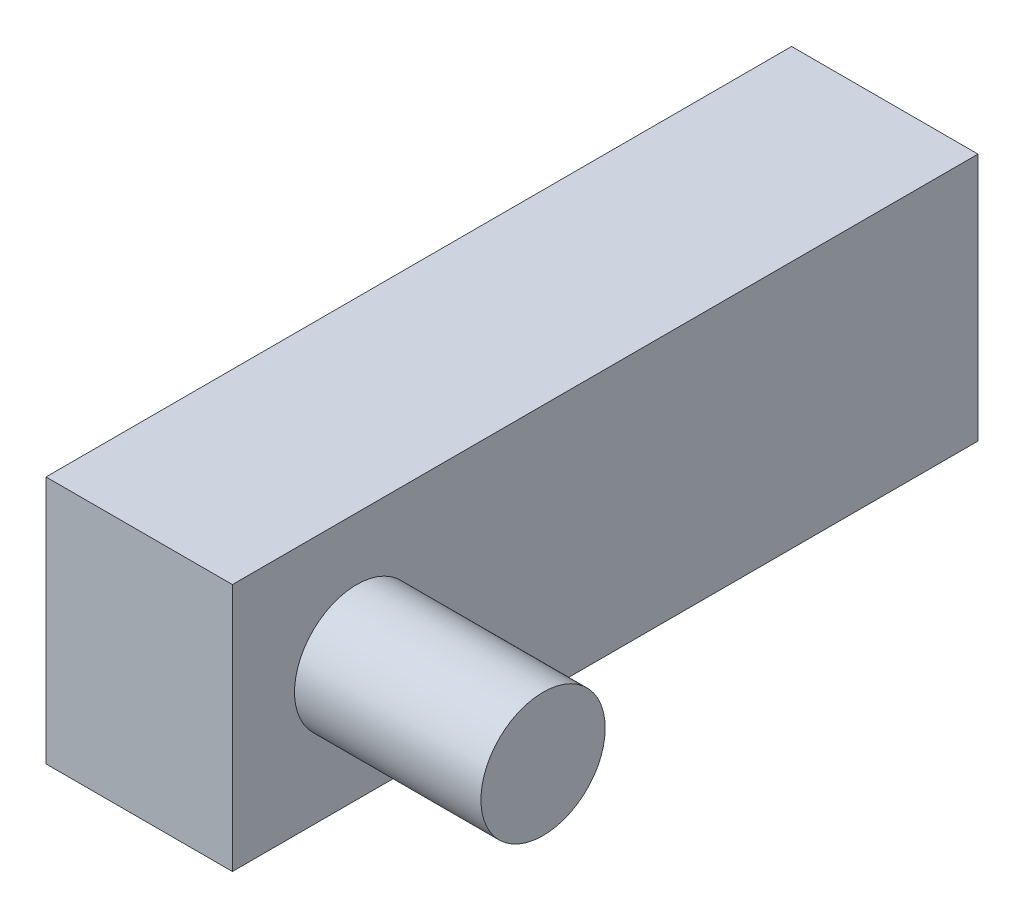
ISO-10303-21;
HEADER;
FILE_DESCRIPTION(('STEP AP214'),'2;1');
FILE_NAME('part.step','',(''),(''),'','','');
FILE_SCHEMA(('AUTOMOTIVE_DESIGN { 1 0 10303 214 1 1 1 1 }'));
ENDSEC;
DATA;
#1=APPLICATION_CONTEXT('core data for automotive mechanical design processes');
#2=APPLICATION_PROTOCOL_DEFINITION('international standard','automotive_design',2000,#1);
#3=PRODUCT_CONTEXT('',#1,'mechanical');
#4=PRODUCT('Part','Part','',(#3));
#5=PRODUCT_RELATED_PRODUCT_CATEGORY('part','',(#4));
#6=PRODUCT_DEFINITION_FORMATION('','',#4);
#7=PRODUCT_DEFINITION_CONTEXT('part definition',#1,'design');
#8=PRODUCT_DEFINITION('design','',#6,#7);
#9=PRODUCT_DEFINITION_SHAPE('','',#8);
#10=(LENGTH_UNIT() NAMED_UNIT(*) SI_UNIT(.MILLI.,.METRE.));
#11=(NAMED_UNIT(*) PLANE_ANGLE_UNIT() SI_UNIT($,.RADIAN.));
#12=(NAMED_UNIT(*) SI_UNIT($,.STERADIAN.) SOLID_ANGLE_UNIT());
#13=UNCERTAINTY_MEASURE_WITH_UNIT(LENGTH_MEASURE(1.E-05),#10,'distance_accuracy_value','');
#14=(GEOMETRIC_REPRESENTATION_CONTEXT(3) GLOBAL_UNCERTAINTY_ASSIGNED_CONTEXT((#13)) GLOBAL_UNIT_ASSIGNED_CONTEXT((#10,
#11,#12)) REPRESENTATION_CONTEXT('',''));
#15=CARTESIAN_POINT('',(0.,0.,0.));
#16=DIRECTION('',(0.,0.,1.));
#17=DIRECTION('',(1.,0.,0.));
#18=AXIS2_PLACEMENT_3D('',#15,#16,#17);
#19=CARTESIAN_POINT('',(-15.,0.,0.));
#20=DIRECTION('',(1.,0.,0.));
#21=DIRECTION('',(0.,0.,-1.));
#22=AXIS2_PLACEMENT_3D('',#19,#20,#21);
#23=CYLINDRICAL_SURFACE('',#22,5.);
#24=CARTESIAN_POINT('',(-15.,0.,0.));
#25=DIRECTION('',(1.,0.,0.));
#26=DIRECTION('',(0.,0.,-1.));
#27=AXIS2_PLACEMENT_3D('',#24,#25,#26);
#28=CIRCLE('',#27,5.);
#29=CARTESIAN_POINT('',(-15.,0.,-5.));
#30=VERTEX_POINT('',#29);
#31=EDGE_CURVE('E47',#30,#30,#28,.T.);
#32=ORIENTED_EDGE('',*,*,#31,.T.);
#33=EDGE_LOOP('',(#32));
#34=FACE_BOUND('',#33,.T.);
#35=CARTESIAN_POINT('',(0.,0.,0.));
#36=DIRECTION('',(1.,0.,0.));
#37=DIRECTION('',(0.,0.,-1.));
#38=AXIS2_PLACEMENT_3D('',#35,#36,#37);
#39=CIRCLE('',#38,5.);
#40=CARTESIAN_POINT('',(0.,0.,-5.));
#41=VERTEX_POINT('',#40);
#42=EDGE_CURVE('E11',#41,#41,#39,.T.);
#43=ORIENTED_EDGE('',*,*,#42,.F.);
#44=EDGE_LOOP('',(#43));
#45=FACE_BOUND('',#44,.T.);
#46=ADVANCED_FACE('F39',(#34,#45),#23,.T.);
#47=CARTESIAN_POINT('',(0.,0.,0.));
#48=DIRECTION('',(1.,0.,0.));
#49=DIRECTION('',(0.,0.,-1.));
#50=AXIS2_PLACEMENT_3D('',#47,#48,#49);
#51=PLANE('',#50);
#52=ORIENTED_EDGE('',*,*,#42,.T.);
#53=EDGE_LOOP('',(#52));
#54=FACE_BOUND('',#53,.T.);
#55=ADVANCED_FACE('F144',(#54),#51,.T.);
#56=CARTESIAN_POINT('',(-30.,-10.,-50.));
#57=DIRECTION('',(0.,-1.,0.));
#58=DIRECTION('',(0.,0.,-1.));
#59=AXIS2_PLACEMENT_3D('',#56,#57,#58);
#60=PLANE('',#59);
#61=DIRECTION('',(0.,0.,1.));
#62=VECTOR('',#61,1.);
#63=CARTESIAN_POINT('',(-15.,-10.,-50.));
#64=LINE('',#63,#62);
#65=CARTESIAN_POINT('',(-15.,-10.,-50.));
#66=VERTEX_POINT('',#65);
#67=CARTESIAN_POINT('',(-15.,-10.,10.));
#68=VERTEX_POINT('',#67);
#69=EDGE_CURVE('E54',#66,#68,#64,.T.);
#70=ORIENTED_EDGE('',*,*,#69,.T.);
#71=DIRECTION('',(1.,0.,0.));
#72=VECTOR('',#71,1.);
#73=CARTESIAN_POINT('',(-30.,-10.,10.));
#74=LINE('',#73,#72);
#75=CARTESIAN_POINT('',(-30.,-10.,10.));
#76=VERTEX_POINT('',#75);
#77=EDGE_CURVE('E99',#76,#68,#74,.T.);
#78=ORIENTED_EDGE('',*,*,#77,.F.);
#79=DIRECTION('',(0.,0.,1.));
#80=VECTOR('',#79,1.);
#81=CARTESIAN_POINT('',(-30.,-10.,-50.));
#82=LINE('',#81,#80);
#83=CARTESIAN_POINT('',(-30.,-10.,-50.));
#84=VERTEX_POINT('',#83);
#85=EDGE_CURVE('E62',#84,#76,#82,.T.);
#86=ORIENTED_EDGE('',*,*,#85,.F.);
#87=DIRECTION('',(1.,0.,0.));
#88=VECTOR('',#87,1.);
#89=CARTESIAN_POINT('',(-30.,-10.,-50.));
#90=LINE('',#89,#88);
#91=EDGE_CURVE('E90',#84,#66,#90,.T.);
#92=ORIENTED_EDGE('',*,*,#91,.T.);
#93=EDGE_LOOP('',(#70,#78,#86,#92));
#94=FACE_BOUND('',#93,.T.);
#95=ADVANCED_FACE('F148',(#94),#60,.T.);
#96=CARTESIAN_POINT('',(-30.,10.,-50.));
#97=DIRECTION('',(-1.,0.,0.));
#98=DIRECTION('',(0.,-1.,0.));
#99=AXIS2_PLACEMENT_3D('',#96,#97,#98);
#100=PLANE('',#99);
#101=ORIENTED_EDGE('',*,*,#85,.T.);
#102=DIRECTION('',(0.,-1.,0.));
#103=VECTOR('',#102,1.);
#104=CARTESIAN_POINT('',(-30.,10.,10.));
#105=LINE('',#104,#103);
#106=CARTESIAN_POINT('',(-30.,10.,10.));
#107=VERTEX_POINT('',#106);
#108=EDGE_CURVE('E104',#107,#76,#105,.T.);
#109=ORIENTED_EDGE('',*,*,#108,.F.);
#110=DIRECTION('',(0.,0.,1.));
#111=VECTOR('',#110,1.);
#112=CARTESIAN_POINT('',(-30.,10.,-50.));
#113=LINE('',#112,#111);
#114=CARTESIAN_POINT('',(-30.,10.,-50.));
#115=VERTEX_POINT('',#114);
#116=EDGE_CURVE('E89',#115,#107,#113,.T.);
#117=ORIENTED_EDGE('',*,*,#116,.F.);
#118=DIRECTION('',(0.,-1.,0.));
#119=VECTOR('',#118,1.);
#120=CARTESIAN_POINT('',(-30.,10.,-50.));
#121=LINE('',#120,#119);
#122=EDGE_CURVE('E116',#115,#84,#121,.T.);
#123=ORIENTED_EDGE('',*,*,#122,.T.);
#124=EDGE_LOOP('',(#101,#109,#117,#123));
#125=FACE_BOUND('',#124,.T.);
#126=ADVANCED_FACE('F141',(#125),#100,.T.);
#127=CARTESIAN_POINT('',(-15.,10.,-50.));
#128=DIRECTION('',(0.,1.,0.));
#129=DIRECTION('',(-1.,0.,0.));
#130=AXIS2_PLACEMENT_3D('',#127,#128,#129);
#131=PLANE('',#130);
#132=ORIENTED_EDGE('',*,*,#116,.T.);
#133=DIRECTION('',(-1.,0.,0.));
#134=VECTOR('',#133,1.);
#135=CARTESIAN_POINT('',(-15.,10.,10.));
#136=LINE('',#135,#134);
#137=CARTESIAN_POINT('',(-15.,10.,10.));
#138=VERTEX_POINT('',#137);
#139=EDGE_CURVE('E97',#138,#107,#136,.T.);
#140=ORIENTED_EDGE('',*,*,#139,.F.);
#141=DIRECTION('',(0.,0.,1.));
#142=VECTOR('',#141,1.);
#143=CARTESIAN_POINT('',(-15.,10.,-50.));
#144=LINE('',#143,#142);
#145=CARTESIAN_POINT('',(-15.,10.,-50.));
#146=VERTEX_POINT('',#145);
#147=EDGE_CURVE('E79',#146,#138,#144,.T.);
#148=ORIENTED_EDGE('',*,*,#147,.F.);
#149=DIRECTION('',(-1.,0.,0.));
#150=VECTOR('',#149,1.);
#151=CARTESIAN_POINT('',(-15.,10.,-50.));
#152=LINE('',#151,#150);
#153=EDGE_CURVE('E113',#146,#115,#152,.T.);
#154=ORIENTED_EDGE('',*,*,#153,.T.);
#155=EDGE_LOOP('',(#132,#140,#148,#154));
#156=FACE_BOUND('',#155,.T.);
#157=ADVANCED_FACE('F102',(#156),#131,.T.);
#158=CARTESIAN_POINT('',(-15.,0.,-50.));
#159=DIRECTION('',(1.,0.,0.));
#160=DIRECTION('',(0.,0.,-1.));
#161=AXIS2_PLACEMENT_3D('',#158,#159,#160);
#162=PLANE('',#161);
#163=ORIENTED_EDGE('',*,*,#31,.F.);
#164=EDGE_LOOP('',(#163));
#165=FACE_BOUND('',#164,.T.);
#166=ORIENTED_EDGE('',*,*,#147,.T.);
#167=DIRECTION('',(0.,1.,0.));
#168=VECTOR('',#167,1.);
#169=CARTESIAN_POINT('',(-15.,-10.,10.));
#170=LINE('',#169,#168);
#171=EDGE_CURVE('E82',#68,#138,#170,.T.);
#172=ORIENTED_EDGE('',*,*,#171,.F.);
#173=ORIENTED_EDGE('',*,*,#69,.F.);
#174=DIRECTION('',(0.,1.,0.));
#175=VECTOR('',#174,1.);
#176=CARTESIAN_POINT('',(-15.,-10.,-50.));
#177=LINE('',#176,#175);
#178=EDGE_CURVE('E83',#66,#146,#177,.T.);
#179=ORIENTED_EDGE('',*,*,#178,.T.);
#180=EDGE_LOOP('',(#166,#172,#173,#179));
#181=FACE_BOUND('',#180,.T.);
#182=ADVANCED_FACE('F81',(#165,#181),#162,.T.);
#183=CARTESIAN_POINT('',(0.,0.,-50.));
#184=DIRECTION('',(0.,0.,1.));
#185=DIRECTION('',(1.,0.,0.));
#186=AXIS2_PLACEMENT_3D('',#183,#184,#185);
#187=PLANE('',#186);
#188=ORIENTED_EDGE('',*,*,#178,.F.);
#189=ORIENTED_EDGE('',*,*,#91,.F.);
#190=ORIENTED_EDGE('',*,*,#122,.F.);
#191=ORIENTED_EDGE('',*,*,#153,.F.);
#192=EDGE_LOOP('',(#188,#189,#190,#191));
#193=FACE_BOUND('',#192,.T.);
#194=ADVANCED_FACE('F133',(#193),#187,.F.);
#195=CARTESIAN_POINT('',(0.,0.,10.));
#196=DIRECTION('',(0.,0.,1.));
#197=DIRECTION('',(1.,0.,0.));
#198=AXIS2_PLACEMENT_3D('',#195,#196,#197);
#199=PLANE('',#198);
#200=ORIENTED_EDGE('',*,*,#171,.T.);
#201=ORIENTED_EDGE('',*,*,#139,.T.);
#202=ORIENTED_EDGE('',*,*,#108,.T.);
#203=ORIENTED_EDGE('',*,*,#77,.T.);
#204=EDGE_LOOP('',(#200,#201,#202,#203));
#205=FACE_BOUND('',#204,.T.);
#206=ADVANCED_FACE('F95',(#205),#199,.T.);
#207=CLOSED_SHELL('',(#46,#55,#95,#126,#157,#182,#194,#206));
#208=MANIFOLD_SOLID_BREP('B2',#207);
#209=ADVANCED_BREP_SHAPE_REPRESENTATION('',(#18,#208),#14);
#210=SHAPE_DEFINITION_REPRESENTATION(#9,#209);
ENDSEC;
END-ISO-10303-21;
